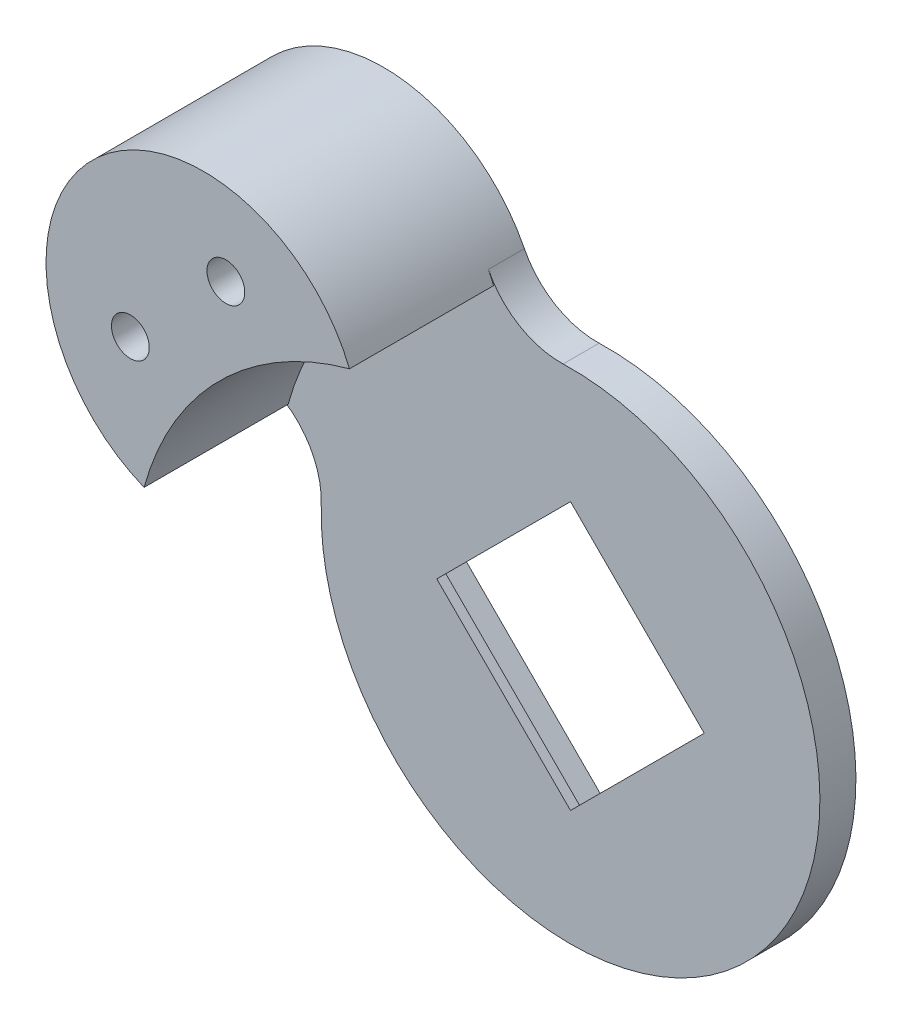
ISO-10303-21;
HEADER;
FILE_DESCRIPTION(('STEP AP214'),'2;1');
FILE_NAME('part.step','',(''),(''),'','','');
FILE_SCHEMA(('AUTOMOTIVE_DESIGN { 1 0 10303 214 1 1 1 1 }'));
ENDSEC;
DATA;
#1=APPLICATION_CONTEXT('core data for automotive mechanical design processes');
#2=APPLICATION_PROTOCOL_DEFINITION('international standard','automotive_design',2000,#1);
#3=PRODUCT_CONTEXT('',#1,'mechanical');
#4=PRODUCT('Part','Part','',(#3));
#5=PRODUCT_RELATED_PRODUCT_CATEGORY('part','',(#4));
#6=PRODUCT_DEFINITION_FORMATION('','',#4);
#7=PRODUCT_DEFINITION_CONTEXT('part definition',#1,'design');
#8=PRODUCT_DEFINITION('design','',#6,#7);
#9=PRODUCT_DEFINITION_SHAPE('','',#8);
#10=(LENGTH_UNIT() NAMED_UNIT(*) SI_UNIT(.MILLI.,.METRE.));
#11=(NAMED_UNIT(*) PLANE_ANGLE_UNIT() SI_UNIT($,.RADIAN.));
#12=(NAMED_UNIT(*) SI_UNIT($,.STERADIAN.) SOLID_ANGLE_UNIT());
#13=UNCERTAINTY_MEASURE_WITH_UNIT(LENGTH_MEASURE(1.E-05),#10,'distance_accuracy_value','');
#14=(GEOMETRIC_REPRESENTATION_CONTEXT(3) GLOBAL_UNCERTAINTY_ASSIGNED_CONTEXT((#13)) GLOBAL_UNIT_ASSIGNED_CONTEXT((#10,
#11,#12)) REPRESENTATION_CONTEXT('',''));
#15=CARTESIAN_POINT('',(0.,0.,0.));
#16=DIRECTION('',(0.,0.,1.));
#17=DIRECTION('',(1.,0.,0.));
#18=AXIS2_PLACEMENT_3D('',#15,#16,#17);
#19=CARTESIAN_POINT('',(-38.0544919220306,-11.2881540550876,-1.));
#20=DIRECTION('',(0.,0.,1.));
#21=DIRECTION('',(1.,0.,0.));
#22=AXIS2_PLACEMENT_3D('',#19,#20,#21);
#23=PLANE('',#22);
#24=DIRECTION('',(-0.707106781186551,0.707106781186545,0.));
#25=VECTOR('',#24,1.);
#26=CARTESIAN_POINT('',(-23.6035495252337,-24.2058564222823,-1.));
#27=LINE('',#26,#25);
#28=CARTESIAN_POINT('',(-7.340093557943,-40.4693123895728,-1.));
#29=VERTEX_POINT('',#28);
#30=CARTESIAN_POINT('',(-23.6035495252337,-24.2058564222823,-1.));
#31=VERTEX_POINT('',#30);
#32=EDGE_CURVE('E183',#29,#31,#27,.T.);
#33=ORIENTED_EDGE('',*,*,#32,.T.);
#34=DIRECTION('',(0.707106781186544,0.707106781186551,0.));
#35=VECTOR('',#34,1.);
#36=CARTESIAN_POINT('',(-23.6035495252337,-24.2058564222823,-1.));
#37=LINE('',#36,#35);
#38=CARTESIAN_POINT('',(-7.34009355794314,-7.94240045499165,-1.));
#39=VERTEX_POINT('',#38);
#40=EDGE_CURVE('E171',#31,#39,#37,.T.);
#41=ORIENTED_EDGE('',*,*,#40,.T.);
#42=DIRECTION('',(0.707106781186551,-0.707106781186545,0.));
#43=VECTOR('',#42,1.);
#44=CARTESIAN_POINT('',(-7.34009355794314,-7.94240045499165,-1.));
#45=LINE('',#44,#43);
#46=CARTESIAN_POINT('',(8.92336240934752,-24.2058564222822,-1.));
#47=VERTEX_POINT('',#46);
#48=EDGE_CURVE('E192',#39,#47,#45,.T.);
#49=ORIENTED_EDGE('',*,*,#48,.T.);
#50=DIRECTION('',(-0.707106781186544,-0.707106781186551,0.));
#51=VECTOR('',#50,1.);
#52=CARTESIAN_POINT('',(-7.340093557943,-40.4693123895728,-1.));
#53=LINE('',#52,#51);
#54=EDGE_CURVE('E188',#47,#29,#53,.T.);
#55=ORIENTED_EDGE('',*,*,#54,.T.);
#56=EDGE_LOOP('',(#33,#41,#49,#55));
#57=FACE_BOUND('',#56,.T.);
#58=DIRECTION('',(-0.707106781186544,-0.707106781186551,0.));
#59=VECTOR('',#58,1.);
#60=CARTESIAN_POINT('',(7.50914884697442,-24.2058564222822,-1.));
#61=LINE('',#60,#59);
#62=CARTESIAN_POINT('',(7.50914884697442,-24.2058564222822,-1.));
#63=VERTEX_POINT('',#62);
#64=CARTESIAN_POINT('',(-7.340093557943,-39.0550988271997,-1.));
#65=VERTEX_POINT('',#64);
#66=EDGE_CURVE('E152',#63,#65,#61,.T.);
#67=ORIENTED_EDGE('',*,*,#66,.F.);
#68=DIRECTION('',(0.707106781186551,-0.707106781186545,0.));
#69=VECTOR('',#68,1.);
#70=CARTESIAN_POINT('',(-7.34009355794314,-9.35661401736475,-1.));
#71=LINE('',#70,#69);
#72=CARTESIAN_POINT('',(-7.34009355794314,-9.35661401736475,-1.));
#73=VERTEX_POINT('',#72);
#74=EDGE_CURVE('E149',#73,#63,#71,.T.);
#75=ORIENTED_EDGE('',*,*,#74,.F.);
#76=DIRECTION('',(0.707106781186544,0.707106781186551,0.));
#77=VECTOR('',#76,1.);
#78=CARTESIAN_POINT('',(-22.1893359628606,-24.2058564222823,-1.));
#79=LINE('',#78,#77);
#80=CARTESIAN_POINT('',(-22.1893359628606,-24.2058564222823,-1.));
#81=VERTEX_POINT('',#80);
#82=EDGE_CURVE('E56',#81,#73,#79,.T.);
#83=ORIENTED_EDGE('',*,*,#82,.F.);
#84=DIRECTION('',(-0.707106781186551,0.707106781186545,0.));
#85=VECTOR('',#84,1.);
#86=CARTESIAN_POINT('',(-7.340093557943,-39.0550988271997,-1.));
#87=LINE('',#86,#85);
#88=EDGE_CURVE('E144',#65,#81,#87,.T.);
#89=ORIENTED_EDGE('',*,*,#88,.F.);
#90=EDGE_LOOP('',(#67,#75,#83,#89));
#91=FACE_BOUND('',#90,.T.);
#92=ADVANCED_FACE('F41',(#57,#91),#23,.F.);
#93=CARTESIAN_POINT('',(-7.34009355794329,-24.2058564222818,16.));
#94=DIRECTION('',(0.,0.,-1.));
#95=DIRECTION('',(-1.,0.,0.));
#96=AXIS2_PLACEMENT_3D('',#93,#94,#95);
#97=CYLINDRICAL_SURFACE('',#96,32.5);
#98=CARTESIAN_POINT('',(-7.34009355794329,-24.2058564222818,0.));
#99=DIRECTION('',(0.,0.,-1.));
#100=DIRECTION('',(1.,0.,0.));
#101=AXIS2_PLACEMENT_3D('',#98,#99,#100);
#102=CIRCLE('',#101,32.5);
#103=CARTESIAN_POINT('',(-38.6968344719005,-15.6615718264268,0.));
#104=VERTEX_POINT('',#103);
#105=CARTESIAN_POINT('',(-15.8843781537988,7.15088449167523,0.));
#106=VERTEX_POINT('',#105);
#107=EDGE_CURVE('E247',#104,#106,#102,.T.);
#108=ORIENTED_EDGE('',*,*,#107,.T.);
#109=DIRECTION('',(0.,0.,-1.));
#110=VECTOR('',#109,1.);
#111=CARTESIAN_POINT('',(-15.8843781537988,7.15088449167523,16.));
#112=LINE('',#111,#110);
#113=CARTESIAN_POINT('',(-15.8843781537988,7.15088449167523,16.));
#114=VERTEX_POINT('',#113);
#115=EDGE_CURVE('E262',#114,#106,#112,.T.);
#116=ORIENTED_EDGE('',*,*,#115,.F.);
#117=CARTESIAN_POINT('',(-7.34009355794329,-24.2058564222818,16.));
#118=DIRECTION('',(0.,0.,-1.));
#119=DIRECTION('',(1.,0.,0.));
#120=AXIS2_PLACEMENT_3D('',#117,#118,#119);
#121=CIRCLE('',#120,32.5);
#122=CARTESIAN_POINT('',(-38.6968344719005,-15.6615718264268,16.));
#123=VERTEX_POINT('',#122);
#124=EDGE_CURVE('E248',#123,#114,#121,.T.);
#125=ORIENTED_EDGE('',*,*,#124,.F.);
#126=DIRECTION('',(0.,0.,-1.));
#127=VECTOR('',#126,1.);
#128=CARTESIAN_POINT('',(-38.6968344719005,-15.6615718264268,16.));
#129=LINE('',#128,#127);
#130=EDGE_CURVE('E254',#123,#104,#129,.T.);
#131=ORIENTED_EDGE('',*,*,#130,.T.);
#132=EDGE_LOOP('',(#108,#116,#125,#131));
#133=FACE_BOUND('',#132,.T.);
#134=ADVANCED_FACE('F43',(#133),#97,.F.);
#135=CARTESIAN_POINT('',(-32.0888308994729,0.542880919247368,16.));
#136=DIRECTION('',(0.,0.,-1.));
#137=DIRECTION('',(-1.,0.,0.));
#138=AXIS2_PLACEMENT_3D('',#135,#136,#137);
#139=CYLINDRICAL_SURFACE('',#138,17.5000000000001);
#140=CARTESIAN_POINT('',(-32.0888308994729,0.542880919247368,0.));
#141=DIRECTION('',(0.,0.,1.));
#142=DIRECTION('',(1.,0.,0.));
#143=AXIS2_PLACEMENT_3D('',#140,#141,#142);
#144=CIRCLE('',#143,17.5000000000001);
#145=CARTESIAN_POINT('',(-16.4629356503513,8.42205585470107,0.));
#146=VERTEX_POINT('',#145);
#147=EDGE_CURVE('E252',#106,#146,#144,.T.);
#148=ORIENTED_EDGE('',*,*,#147,.T.);
#149=DIRECTION('',(0.,0.,1.));
#150=VECTOR('',#149,1.);
#151=CARTESIAN_POINT('',(-16.4629356503513,8.42205585470107,-4.));
#152=LINE('',#151,#150);
#153=CARTESIAN_POINT('',(-16.4629356503513,8.42205585470107,-4.));
#154=VERTEX_POINT('',#153);
#155=EDGE_CURVE('E242',#154,#146,#152,.T.);
#156=ORIENTED_EDGE('',*,*,#155,.F.);
#157=CARTESIAN_POINT('',(-32.0888308994729,0.542880919247368,-4.));
#158=DIRECTION('',(0.,0.,-1.));
#159=DIRECTION('',(-1.,0.,0.));
#160=AXIS2_PLACEMENT_3D('',#157,#158,#159);
#161=CIRCLE('',#160,17.5000000000001);
#162=CARTESIAN_POINT('',(-39.9680058349265,-15.0830143298743,-4.));
#163=VERTEX_POINT('',#162);
#164=EDGE_CURVE('E224',#163,#154,#161,.T.);
#165=ORIENTED_EDGE('',*,*,#164,.F.);
#166=DIRECTION('',(0.,0.,1.));
#167=VECTOR('',#166,1.);
#168=CARTESIAN_POINT('',(-39.9680058349265,-15.0830143298743,-4.));
#169=LINE('',#168,#167);
#170=CARTESIAN_POINT('',(-39.9680058349265,-15.0830143298743,0.));
#171=VERTEX_POINT('',#170);
#172=EDGE_CURVE('E244',#163,#171,#169,.T.);
#173=ORIENTED_EDGE('',*,*,#172,.T.);
#174=EDGE_CURVE('E257',#171,#104,#144,.T.);
#175=ORIENTED_EDGE('',*,*,#174,.T.);
#176=ORIENTED_EDGE('',*,*,#130,.F.);
#177=CARTESIAN_POINT('',(-32.0888308994729,0.542880919247368,16.));
#178=DIRECTION('',(0.,0.,1.));
#179=DIRECTION('',(1.,0.,0.));
#180=AXIS2_PLACEMENT_3D('',#177,#178,#179);
#181=CIRCLE('',#180,17.5000000000001);
#182=EDGE_CURVE('E251',#114,#123,#181,.T.);
#183=ORIENTED_EDGE('',*,*,#182,.F.);
#184=ORIENTED_EDGE('',*,*,#115,.T.);
#185=EDGE_LOOP('',(#148,#156,#165,#173,#175,#176,#183,#184));
#186=FACE_BOUND('',#185,.T.);
#187=ADVANCED_FACE('F289',(#186),#139,.T.);
#188=CARTESIAN_POINT('',(-19.7144622287081,-11.8314877515172,16.));
#189=DIRECTION('',(0.,0.,1.));
#190=DIRECTION('',(1.,0.,0.));
#191=AXIS2_PLACEMENT_3D('',#188,#189,#190);
#192=PLANE('',#191);
#193=CARTESIAN_POINT('',(-40.2205588831182,-1.93199281490557,16.));
#194=DIRECTION('',(0.,0.,-1.));
#195=DIRECTION('',(-1.,0.,0.));
#196=AXIS2_PLACEMENT_3D('',#193,#194,#195);
#197=CIRCLE('',#196,2.1);
#198=CARTESIAN_POINT('',(-42.3205588831182,-1.93199281490557,16.));
#199=VERTEX_POINT('',#198);
#200=EDGE_CURVE('E213',#199,#199,#197,.T.);
#201=ORIENTED_EDGE('',*,*,#200,.T.);
#202=EDGE_LOOP('',(#201));
#203=FACE_BOUND('',#202,.T.);
#204=CARTESIAN_POINT('',(-29.61395716532,8.67460890289268,16.));
#205=DIRECTION('',(0.,0.,-1.));
#206=DIRECTION('',(-1.,0.,0.));
#207=AXIS2_PLACEMENT_3D('',#204,#205,#206);
#208=CIRCLE('',#207,2.1);
#209=CARTESIAN_POINT('',(-31.71395716532,8.67460890289268,16.));
#210=VERTEX_POINT('',#209);
#211=EDGE_CURVE('E217',#210,#210,#208,.T.);
#212=ORIENTED_EDGE('',*,*,#211,.T.);
#213=EDGE_LOOP('',(#212));
#214=FACE_BOUND('',#213,.T.);
#215=ORIENTED_EDGE('',*,*,#124,.T.);
#216=ORIENTED_EDGE('',*,*,#182,.T.);
#217=EDGE_LOOP('',(#215,#216));
#218=FACE_BOUND('',#217,.T.);
#219=ADVANCED_FACE('F357',(#203,#214,#218),#192,.T.);
#220=CARTESIAN_POINT('',(-44.0201529445883,-23.1191890294226,-4.));
#221=DIRECTION('',(0.,0.,1.));
#222=DIRECTION('',(1.,0.,0.));
#223=AXIS2_PLACEMENT_3D('',#220,#221,#222);
#224=CYLINDRICAL_SURFACE('',#223,9.);
#225=CARTESIAN_POINT('',(-44.0201529445883,-23.1191890294226,0.));
#226=DIRECTION('',(0.,0.,1.));
#227=DIRECTION('',(1.,0.,0.));
#228=AXIS2_PLACEMENT_3D('',#225,#226,#227);
#229=CIRCLE('',#228,9.);
#230=CARTESIAN_POINT('',(-35.0240998794845,-23.3857021620006,0.));
#231=VERTEX_POINT('',#230);
#232=EDGE_CURVE('E216',#231,#171,#229,.T.);
#233=ORIENTED_EDGE('',*,*,#232,.T.);
#234=ORIENTED_EDGE('',*,*,#172,.F.);
#235=CARTESIAN_POINT('',(-44.0201529445883,-23.1191890294226,-4.));
#236=DIRECTION('',(0.,0.,1.));
#237=DIRECTION('',(1.,0.,0.));
#238=AXIS2_PLACEMENT_3D('',#235,#236,#237);
#239=CIRCLE('',#238,9.);
#240=CARTESIAN_POINT('',(-35.0240998794845,-23.3857021620006,-4.));
#241=VERTEX_POINT('',#240);
#242=EDGE_CURVE('E221',#241,#163,#239,.T.);
#243=ORIENTED_EDGE('',*,*,#242,.F.);
#244=DIRECTION('',(0.,0.,1.));
#245=VECTOR('',#244,1.);
#246=CARTESIAN_POINT('',(-35.0240998794845,-23.3857021620006,-4.));
#247=LINE('',#246,#245);
#248=EDGE_CURVE('E231',#241,#231,#247,.T.);
#249=ORIENTED_EDGE('',*,*,#248,.T.);
#250=EDGE_LOOP('',(#233,#234,#243,#249));
#251=FACE_BOUND('',#250,.T.);
#252=ADVANCED_FACE('F296',(#251),#224,.F.);
#253=CARTESIAN_POINT('',(-8.42676095080308,12.474202964363,-4.));
#254=DIRECTION('',(0.,0.,1.));
#255=DIRECTION('',(1.,0.,0.));
#256=AXIS2_PLACEMENT_3D('',#253,#254,#255);
#257=CYLINDRICAL_SURFACE('',#256,9.);
#258=CARTESIAN_POINT('',(-8.42676095080308,12.474202964363,0.));
#259=DIRECTION('',(0.,0.,1.));
#260=DIRECTION('',(-1.,0.,0.));
#261=AXIS2_PLACEMENT_3D('',#258,#259,#260);
#262=CIRCLE('',#261,9.);
#263=CARTESIAN_POINT('',(-8.16024781822495,3.47814989925916,0.));
#264=VERTEX_POINT('',#263);
#265=EDGE_CURVE('E234',#146,#264,#262,.T.);
#266=ORIENTED_EDGE('',*,*,#265,.T.);
#267=DIRECTION('',(0.,0.,1.));
#268=VECTOR('',#267,1.);
#269=CARTESIAN_POINT('',(-8.16024781822495,3.47814989925916,-4.));
#270=LINE('',#269,#268);
#271=CARTESIAN_POINT('',(-8.16024781822495,3.47814989925916,-4.));
#272=VERTEX_POINT('',#271);
#273=EDGE_CURVE('E239',#272,#264,#270,.T.);
#274=ORIENTED_EDGE('',*,*,#273,.F.);
#275=CARTESIAN_POINT('',(-8.42676095080308,12.474202964363,-4.));
#276=DIRECTION('',(0.,0.,1.));
#277=DIRECTION('',(-1.,0.,0.));
#278=AXIS2_PLACEMENT_3D('',#275,#276,#277);
#279=CIRCLE('',#278,9.);
#280=EDGE_CURVE('E227',#154,#272,#279,.T.);
#281=ORIENTED_EDGE('',*,*,#280,.F.);
#282=ORIENTED_EDGE('',*,*,#155,.T.);
#283=EDGE_LOOP('',(#266,#274,#281,#282));
#284=FACE_BOUND('',#283,.T.);
#285=ADVANCED_FACE('F305',(#284),#257,.F.);
#286=CARTESIAN_POINT('',(-7.34009355794307,-24.2058564222822,-4.));
#287=DIRECTION('',(0.,0.,1.));
#288=DIRECTION('',(1.,0.,0.));
#289=AXIS2_PLACEMENT_3D('',#286,#287,#288);
#290=CYLINDRICAL_SURFACE('',#289,27.6961524227067);
#291=CARTESIAN_POINT('',(-7.34009355794307,-24.2058564222822,0.));
#292=DIRECTION('',(0.,0.,-1.));
#293=DIRECTION('',(-1.,0.,0.));
#294=AXIS2_PLACEMENT_3D('',#291,#292,#293);
#295=CIRCLE('',#294,27.6961524227067);
#296=EDGE_CURVE('E225',#264,#231,#295,.T.);
#297=ORIENTED_EDGE('',*,*,#296,.T.);
#298=ORIENTED_EDGE('',*,*,#248,.F.);
#299=CARTESIAN_POINT('',(-7.34009355794307,-24.2058564222822,-4.));
#300=DIRECTION('',(0.,0.,-1.));
#301=DIRECTION('',(-1.,0.,0.));
#302=AXIS2_PLACEMENT_3D('',#299,#300,#301);
#303=CIRCLE('',#302,27.6961524227067);
#304=EDGE_CURVE('E229',#272,#241,#303,.T.);
#305=ORIENTED_EDGE('',*,*,#304,.F.);
#306=ORIENTED_EDGE('',*,*,#273,.T.);
#307=EDGE_LOOP('',(#297,#298,#305,#306));
#308=FACE_BOUND('',#307,.T.);
#309=ADVANCED_FACE('F301',(#308),#290,.T.);
#310=CARTESIAN_POINT('',(-38.0544919220306,-11.2881540550876,-4.));
#311=DIRECTION('',(0.,0.,1.));
#312=DIRECTION('',(1.,0.,0.));
#313=AXIS2_PLACEMENT_3D('',#310,#311,#312);
#314=PLANE('',#313);
#315=DIRECTION('',(0.70710678118655,-0.707106781186544,0.));
#316=VECTOR('',#315,1.);
#317=CARTESIAN_POINT('',(-7.34009355794314,-7.94240045499165,-4.));
#318=LINE('',#317,#316);
#319=CARTESIAN_POINT('',(-7.34009355794314,-7.94240045499165,-4.));
#320=VERTEX_POINT('',#319);
#321=CARTESIAN_POINT('',(8.92336240934752,-24.2058564222822,-4.));
#322=VERTEX_POINT('',#321);
#323=EDGE_CURVE('E172',#320,#322,#318,.T.);
#324=ORIENTED_EDGE('',*,*,#323,.F.);
#325=DIRECTION('',(0.707106781186544,0.707106781186551,0.));
#326=VECTOR('',#325,1.);
#327=CARTESIAN_POINT('',(-23.6035495252337,-24.2058564222823,-4.));
#328=LINE('',#327,#326);
#329=CARTESIAN_POINT('',(-23.6035495252337,-24.2058564222823,-4.));
#330=VERTEX_POINT('',#329);
#331=EDGE_CURVE('E175',#330,#320,#328,.T.);
#332=ORIENTED_EDGE('',*,*,#331,.F.);
#333=DIRECTION('',(-0.70710678118655,0.707106781186544,0.));
#334=VECTOR('',#333,1.);
#335=CARTESIAN_POINT('',(-23.6035495252337,-24.2058564222823,-4.));
#336=LINE('',#335,#334);
#337=CARTESIAN_POINT('',(-7.340093557943,-40.4693123895728,-4.));
#338=VERTEX_POINT('',#337);
#339=EDGE_CURVE('E165',#338,#330,#336,.T.);
#340=ORIENTED_EDGE('',*,*,#339,.F.);
#341=DIRECTION('',(-0.707106781186544,-0.707106781186551,0.));
#342=VECTOR('',#341,1.);
#343=CARTESIAN_POINT('',(-7.340093557943,-40.4693123895728,-4.));
#344=LINE('',#343,#342);
#345=EDGE_CURVE('E169',#322,#338,#344,.T.);
#346=ORIENTED_EDGE('',*,*,#345,.F.);
#347=EDGE_LOOP('',(#324,#332,#340,#346));
#348=FACE_BOUND('',#347,.T.);
#349=CARTESIAN_POINT('',(-40.2205588831182,-1.93199281490557,-4.));
#350=DIRECTION('',(0.,0.,-1.));
#351=DIRECTION('',(-1.,0.,0.));
#352=AXIS2_PLACEMENT_3D('',#349,#350,#351);
#353=CIRCLE('',#352,4.00000000000001);
#354=CARTESIAN_POINT('',(-44.2205588831182,-1.93199281490557,-4.));
#355=VERTEX_POINT('',#354);
#356=EDGE_CURVE('E201',#355,#355,#353,.T.);
#357=ORIENTED_EDGE('',*,*,#356,.F.);
#358=EDGE_LOOP('',(#357));
#359=FACE_BOUND('',#358,.T.);
#360=CARTESIAN_POINT('',(-29.61395716532,8.67460890289268,-4.));
#361=DIRECTION('',(0.,0.,-1.));
#362=DIRECTION('',(-1.,0.,0.));
#363=AXIS2_PLACEMENT_3D('',#360,#361,#362);
#364=CIRCLE('',#363,4.00000000000001);
#365=CARTESIAN_POINT('',(-33.61395716532,8.67460890289268,-4.));
#366=VERTEX_POINT('',#365);
#367=EDGE_CURVE('E205',#366,#366,#364,.T.);
#368=ORIENTED_EDGE('',*,*,#367,.F.);
#369=EDGE_LOOP('',(#368));
#370=FACE_BOUND('',#369,.T.);
#371=ORIENTED_EDGE('',*,*,#242,.T.);
#372=ORIENTED_EDGE('',*,*,#164,.T.);
#373=ORIENTED_EDGE('',*,*,#280,.T.);
#374=ORIENTED_EDGE('',*,*,#304,.T.);
#375=EDGE_LOOP('',(#371,#372,#373,#374));
#376=FACE_BOUND('',#375,.T.);
#377=ADVANCED_FACE('F281',(#348,#359,#370,#376),#314,.F.);
#378=CARTESIAN_POINT('',(-38.0544919220306,-11.2881540550876,0.));
#379=DIRECTION('',(0.,0.,1.));
#380=DIRECTION('',(1.,0.,0.));
#381=AXIS2_PLACEMENT_3D('',#378,#379,#380);
#382=PLANE('',#381);
#383=DIRECTION('',(0.707106781186544,0.707106781186551,0.));
#384=VECTOR('',#383,1.);
#385=CARTESIAN_POINT('',(-8.81382035393059,-40.5288256231873,0.));
#386=LINE('',#385,#384);
#387=CARTESIAN_POINT('',(-7.340093557943,-39.0550988271997,0.));
#388=VERTEX_POINT('',#387);
#389=CARTESIAN_POINT('',(7.50914884697442,-24.2058564222822,0.));
#390=VERTEX_POINT('',#389);
#391=EDGE_CURVE('E12',#388,#390,#386,.T.);
#392=ORIENTED_EDGE('',*,*,#391,.F.);
#393=DIRECTION('',(0.707106781186551,-0.707106781186545,0.));
#394=VECTOR('',#393,1.);
#395=CARTESIAN_POINT('',(-36.580765126043,-9.81442725909999,0.));
#396=LINE('',#395,#394);
#397=CARTESIAN_POINT('',(-22.1893359628606,-24.2058564222823,0.));
#398=VERTEX_POINT('',#397);
#399=EDGE_CURVE('E146',#398,#388,#396,.T.);
#400=ORIENTED_EDGE('',*,*,#399,.F.);
#401=DIRECTION('',(-0.707106781186544,-0.707106781186551,0.));
#402=VECTOR('',#401,1.);
#403=CARTESIAN_POINT('',(-23.6630627588481,-25.6795832182699,0.));
#404=LINE('',#403,#402);
#405=CARTESIAN_POINT('',(-7.34009355794314,-9.35661401736475,0.));
#406=VERTEX_POINT('',#405);
#407=EDGE_CURVE('E270',#406,#398,#404,.T.);
#408=ORIENTED_EDGE('',*,*,#407,.F.);
#409=DIRECTION('',(-0.70710678118655,0.707106781186545,0.));
#410=VECTOR('',#409,1.);
#411=CARTESIAN_POINT('',(-21.7315227211256,5.03481514581756,0.));
#412=LINE('',#411,#410);
#413=EDGE_CURVE('E49',#390,#406,#412,.T.);
#414=ORIENTED_EDGE('',*,*,#413,.F.);
#415=EDGE_LOOP('',(#392,#400,#408,#414));
#416=FACE_BOUND('',#415,.T.);
#417=ORIENTED_EDGE('',*,*,#147,.F.);
#418=ORIENTED_EDGE('',*,*,#107,.F.);
#419=ORIENTED_EDGE('',*,*,#174,.F.);
#420=ORIENTED_EDGE('',*,*,#232,.F.);
#421=ORIENTED_EDGE('',*,*,#296,.F.);
#422=ORIENTED_EDGE('',*,*,#265,.F.);
#423=EDGE_LOOP('',(#417,#418,#419,#420,#421,#422));
#424=FACE_BOUND('',#423,.T.);
#425=ADVANCED_FACE('F277',(#416,#424),#382,.T.);
#426=CARTESIAN_POINT('',(-29.61395716532,8.67460890289268,16.));
#427=DIRECTION('',(0.,0.,-1.));
#428=DIRECTION('',(-1.,0.,0.));
#429=AXIS2_PLACEMENT_3D('',#426,#427,#428);
#430=CYLINDRICAL_SURFACE('',#429,2.1);
#431=CARTESIAN_POINT('',(-29.61395716532,8.67460890289268,10.));
#432=DIRECTION('',(0.,0.,1.));
#433=DIRECTION('',(1.,0.,0.));
#434=AXIS2_PLACEMENT_3D('',#431,#432,#433);
#435=CIRCLE('',#434,2.1);
#436=CARTESIAN_POINT('',(-27.51395716532,8.67460890289268,10.));
#437=VERTEX_POINT('',#436);
#438=EDGE_CURVE('E220',#437,#437,#435,.F.);
#439=ORIENTED_EDGE('',*,*,#438,.T.);
#440=EDGE_LOOP('',(#439));
#441=FACE_BOUND('',#440,.T.);
#442=ORIENTED_EDGE('',*,*,#211,.F.);
#443=EDGE_LOOP('',(#442));
#444=FACE_BOUND('',#443,.T.);
#445=ADVANCED_FACE('F280',(#441,#444),#430,.F.);
#446=CARTESIAN_POINT('',(-40.2205588831182,-1.93199281490557,16.));
#447=DIRECTION('',(0.,0.,-1.));
#448=DIRECTION('',(-1.,0.,0.));
#449=AXIS2_PLACEMENT_3D('',#446,#447,#448);
#450=CYLINDRICAL_SURFACE('',#449,2.1);
#451=CARTESIAN_POINT('',(-40.2205588831182,-1.93199281490557,10.));
#452=DIRECTION('',(0.,0.,1.));
#453=DIRECTION('',(1.,0.,0.));
#454=AXIS2_PLACEMENT_3D('',#451,#452,#453);
#455=CIRCLE('',#454,2.1);
#456=CARTESIAN_POINT('',(-38.1205588831182,-1.93199281490557,10.));
#457=VERTEX_POINT('',#456);
#458=EDGE_CURVE('E208',#457,#457,#455,.F.);
#459=ORIENTED_EDGE('',*,*,#458,.T.);
#460=EDGE_LOOP('',(#459));
#461=FACE_BOUND('',#460,.T.);
#462=ORIENTED_EDGE('',*,*,#200,.F.);
#463=EDGE_LOOP('',(#462));
#464=FACE_BOUND('',#463,.T.);
#465=ADVANCED_FACE('F338',(#461,#464),#450,.F.);
#466=CARTESIAN_POINT('',(-19.7144622287081,-11.8314877515172,10.));
#467=DIRECTION('',(0.,0.,1.));
#468=DIRECTION('',(1.,0.,0.));
#469=AXIS2_PLACEMENT_3D('',#466,#467,#468);
#470=PLANE('',#469);
#471=CARTESIAN_POINT('',(-40.2205588831182,-1.93199281490557,10.));
#472=DIRECTION('',(0.,0.,1.));
#473=DIRECTION('',(1.,0.,0.));
#474=AXIS2_PLACEMENT_3D('',#471,#472,#473);
#475=CIRCLE('',#474,4.00000000000001);
#476=CARTESIAN_POINT('',(-36.2205588831182,-1.93199281490557,10.));
#477=VERTEX_POINT('',#476);
#478=EDGE_CURVE('E204',#477,#477,#475,.F.);
#479=ORIENTED_EDGE('',*,*,#478,.T.);
#480=EDGE_LOOP('',(#479));
#481=FACE_BOUND('',#480,.T.);
#482=ORIENTED_EDGE('',*,*,#458,.F.);
#483=EDGE_LOOP('',(#482));
#484=FACE_BOUND('',#483,.T.);
#485=ADVANCED_FACE('F334',(#481,#484),#470,.F.);
#486=CARTESIAN_POINT('',(-40.2205588831182,-1.93199281490557,27.3137084989848));
#487=DIRECTION('',(0.,0.,-1.));
#488=DIRECTION('',(-1.,0.,0.));
#489=AXIS2_PLACEMENT_3D('',#486,#487,#488);
#490=CYLINDRICAL_SURFACE('',#489,4.00000000000001);
#491=ORIENTED_EDGE('',*,*,#356,.T.);
#492=EDGE_LOOP('',(#491));
#493=FACE_BOUND('',#492,.T.);
#494=ORIENTED_EDGE('',*,*,#478,.F.);
#495=EDGE_LOOP('',(#494));
#496=FACE_BOUND('',#495,.T.);
#497=ADVANCED_FACE('F330',(#493,#496),#490,.F.);
#498=CARTESIAN_POINT('',(-19.7144622287081,-11.8314877515172,10.));
#499=DIRECTION('',(0.,0.,1.));
#500=DIRECTION('',(1.,0.,0.));
#501=AXIS2_PLACEMENT_3D('',#498,#499,#500);
#502=PLANE('',#501);
#503=CARTESIAN_POINT('',(-29.61395716532,8.67460890289268,10.));
#504=DIRECTION('',(0.,0.,1.));
#505=DIRECTION('',(1.,0.,0.));
#506=AXIS2_PLACEMENT_3D('',#503,#504,#505);
#507=CIRCLE('',#506,4.00000000000001);
#508=CARTESIAN_POINT('',(-25.61395716532,8.67460890289268,10.));
#509=VERTEX_POINT('',#508);
#510=EDGE_CURVE('E200',#509,#509,#507,.F.);
#511=ORIENTED_EDGE('',*,*,#510,.T.);
#512=EDGE_LOOP('',(#511));
#513=FACE_BOUND('',#512,.T.);
#514=ORIENTED_EDGE('',*,*,#438,.F.);
#515=EDGE_LOOP('',(#514));
#516=FACE_BOUND('',#515,.T.);
#517=ADVANCED_FACE('F333',(#513,#516),#502,.F.);
#518=CARTESIAN_POINT('',(-29.61395716532,8.67460890289268,27.3137084989848));
#519=DIRECTION('',(0.,0.,-1.));
#520=DIRECTION('',(-1.,0.,0.));
#521=AXIS2_PLACEMENT_3D('',#518,#519,#520);
#522=CYLINDRICAL_SURFACE('',#521,4.00000000000001);
#523=ORIENTED_EDGE('',*,*,#367,.T.);
#524=EDGE_LOOP('',(#523));
#525=FACE_BOUND('',#524,.T.);
#526=ORIENTED_EDGE('',*,*,#510,.F.);
#527=EDGE_LOOP('',(#526));
#528=FACE_BOUND('',#527,.T.);
#529=ADVANCED_FACE('F342',(#525,#528),#522,.F.);
#530=CARTESIAN_POINT('',(-23.6035495252337,-24.2058564222823,46.));
#531=DIRECTION('',(-0.707106781186551,0.707106781186544,0.));
#532=DIRECTION('',(-0.707106781186544,-0.707106781186551,0.));
#533=AXIS2_PLACEMENT_3D('',#530,#531,#532);
#534=PLANE('',#533);
#535=DIRECTION('',(0.,0.,-1.));
#536=VECTOR('',#535,1.);
#537=CARTESIAN_POINT('',(-23.6035495252337,-24.2058564222823,46.));
#538=LINE('',#537,#536);
#539=EDGE_CURVE('E186',#31,#330,#538,.T.);
#540=ORIENTED_EDGE('',*,*,#539,.T.);
#541=ORIENTED_EDGE('',*,*,#331,.T.);
#542=DIRECTION('',(0.,0.,-1.));
#543=VECTOR('',#542,1.);
#544=CARTESIAN_POINT('',(-7.34009355794314,-7.94240045499165,46.));
#545=LINE('',#544,#543);
#546=EDGE_CURVE('E182',#39,#320,#545,.T.);
#547=ORIENTED_EDGE('',*,*,#546,.F.);
#548=ORIENTED_EDGE('',*,*,#40,.F.);
#549=EDGE_LOOP('',(#540,#541,#547,#548));
#550=FACE_BOUND('',#549,.T.);
#551=ADVANCED_FACE('F328',(#550),#534,.F.);
#552=CARTESIAN_POINT('',(-7.34009355794314,-7.94240045499165,46.));
#553=DIRECTION('',(0.707106781186544,0.70710678118655,0.));
#554=DIRECTION('',(-0.707106781186551,0.707106781186545,0.));
#555=AXIS2_PLACEMENT_3D('',#552,#553,#554);
#556=PLANE('',#555);
#557=ORIENTED_EDGE('',*,*,#546,.T.);
#558=ORIENTED_EDGE('',*,*,#323,.T.);
#559=DIRECTION('',(0.,0.,-1.));
#560=VECTOR('',#559,1.);
#561=CARTESIAN_POINT('',(8.92336240934752,-24.2058564222822,46.));
#562=LINE('',#561,#560);
#563=EDGE_CURVE('E191',#47,#322,#562,.T.);
#564=ORIENTED_EDGE('',*,*,#563,.F.);
#565=ORIENTED_EDGE('',*,*,#48,.F.);
#566=EDGE_LOOP('',(#557,#558,#564,#565));
#567=FACE_BOUND('',#566,.T.);
#568=ADVANCED_FACE('F431',(#567),#556,.F.);
#569=CARTESIAN_POINT('',(-7.340093557943,-40.4693123895728,46.));
#570=DIRECTION('',(0.707106781186551,-0.707106781186544,0.));
#571=DIRECTION('',(0.707106781186544,0.707106781186551,0.));
#572=AXIS2_PLACEMENT_3D('',#569,#570,#571);
#573=PLANE('',#572);
#574=ORIENTED_EDGE('',*,*,#563,.T.);
#575=ORIENTED_EDGE('',*,*,#345,.T.);
#576=DIRECTION('',(0.,0.,-1.));
#577=VECTOR('',#576,1.);
#578=CARTESIAN_POINT('',(-7.340093557943,-40.4693123895728,46.));
#579=LINE('',#578,#577);
#580=EDGE_CURVE('E187',#29,#338,#579,.T.);
#581=ORIENTED_EDGE('',*,*,#580,.F.);
#582=ORIENTED_EDGE('',*,*,#54,.F.);
#583=EDGE_LOOP('',(#574,#575,#581,#582));
#584=FACE_BOUND('',#583,.T.);
#585=ADVANCED_FACE('F440',(#584),#573,.F.);
#586=CARTESIAN_POINT('',(-23.6035495252337,-24.2058564222823,46.));
#587=DIRECTION('',(-0.707106781186544,-0.70710678118655,0.));
#588=DIRECTION('',(0.707106781186551,-0.707106781186545,0.));
#589=AXIS2_PLACEMENT_3D('',#586,#587,#588);
#590=PLANE('',#589);
#591=ORIENTED_EDGE('',*,*,#580,.T.);
#592=ORIENTED_EDGE('',*,*,#339,.T.);
#593=ORIENTED_EDGE('',*,*,#539,.F.);
#594=ORIENTED_EDGE('',*,*,#32,.F.);
#595=EDGE_LOOP('',(#591,#592,#593,#594));
#596=FACE_BOUND('',#595,.T.);
#597=ADVANCED_FACE('F449',(#596),#590,.F.);
#598=CARTESIAN_POINT('',(7.50914884697442,-24.2058564222822,16.));
#599=DIRECTION('',(0.707106781186551,-0.707106781186544,0.));
#600=DIRECTION('',(0.707106781186544,0.707106781186551,0.));
#601=AXIS2_PLACEMENT_3D('',#598,#599,#600);
#602=PLANE('',#601);
#603=ORIENTED_EDGE('',*,*,#391,.T.);
#604=DIRECTION('',(0.,0.,-1.));
#605=VECTOR('',#604,1.);
#606=CARTESIAN_POINT('',(7.50914884697442,-24.2058564222822,16.));
#607=LINE('',#606,#605);
#608=EDGE_CURVE('E155',#390,#63,#607,.T.);
#609=ORIENTED_EDGE('',*,*,#608,.T.);
#610=ORIENTED_EDGE('',*,*,#66,.T.);
#611=DIRECTION('',(0.,0.,-1.));
#612=VECTOR('',#611,1.);
#613=CARTESIAN_POINT('',(-7.340093557943,-39.0550988271997,16.));
#614=LINE('',#613,#612);
#615=EDGE_CURVE('E140',#388,#65,#614,.T.);
#616=ORIENTED_EDGE('',*,*,#615,.F.);
#617=EDGE_LOOP('',(#603,#609,#610,#616));
#618=FACE_BOUND('',#617,.T.);
#619=ADVANCED_FACE('F153',(#618),#602,.F.);
#620=CARTESIAN_POINT('',(-7.34009355794314,-9.35661401736475,16.));
#621=DIRECTION('',(0.707106781186545,0.707106781186551,0.));
#622=DIRECTION('',(-0.70710678118655,0.707106781186545,0.));
#623=AXIS2_PLACEMENT_3D('',#620,#621,#622);
#624=PLANE('',#623);
#625=ORIENTED_EDGE('',*,*,#413,.T.);
#626=DIRECTION('',(0.,0.,-1.));
#627=VECTOR('',#626,1.);
#628=CARTESIAN_POINT('',(-7.34009355794314,-9.35661401736475,16.));
#629=LINE('',#628,#627);
#630=EDGE_CURVE('E166',#406,#73,#629,.T.);
#631=ORIENTED_EDGE('',*,*,#630,.T.);
#632=ORIENTED_EDGE('',*,*,#74,.T.);
#633=ORIENTED_EDGE('',*,*,#608,.F.);
#634=EDGE_LOOP('',(#625,#631,#632,#633));
#635=FACE_BOUND('',#634,.T.);
#636=ADVANCED_FACE('F273',(#635),#624,.F.);
#637=CARTESIAN_POINT('',(-22.1893359628606,-24.2058564222823,16.));
#638=DIRECTION('',(-0.707106781186551,0.707106781186544,0.));
#639=DIRECTION('',(-0.707106781186544,-0.707106781186551,0.));
#640=AXIS2_PLACEMENT_3D('',#637,#638,#639);
#641=PLANE('',#640);
#642=ORIENTED_EDGE('',*,*,#407,.T.);
#643=DIRECTION('',(0.,0.,-1.));
#644=VECTOR('',#643,1.);
#645=CARTESIAN_POINT('',(-22.1893359628606,-24.2058564222823,16.));
#646=LINE('',#645,#644);
#647=EDGE_CURVE('E63',#398,#81,#646,.T.);
#648=ORIENTED_EDGE('',*,*,#647,.T.);
#649=ORIENTED_EDGE('',*,*,#82,.T.);
#650=ORIENTED_EDGE('',*,*,#630,.F.);
#651=EDGE_LOOP('',(#642,#648,#649,#650));
#652=FACE_BOUND('',#651,.T.);
#653=ADVANCED_FACE('F276',(#652),#641,.F.);
#654=CARTESIAN_POINT('',(-7.340093557943,-39.0550988271997,16.));
#655=DIRECTION('',(-0.707106781186545,-0.707106781186551,0.));
#656=DIRECTION('',(0.707106781186551,-0.707106781186545,0.));
#657=AXIS2_PLACEMENT_3D('',#654,#655,#656);
#658=PLANE('',#657);
#659=ORIENTED_EDGE('',*,*,#399,.T.);
#660=ORIENTED_EDGE('',*,*,#615,.T.);
#661=ORIENTED_EDGE('',*,*,#88,.T.);
#662=ORIENTED_EDGE('',*,*,#647,.F.);
#663=EDGE_LOOP('',(#659,#660,#661,#662));
#664=FACE_BOUND('',#663,.T.);
#665=ADVANCED_FACE('F142',(#664),#658,.F.);
#666=CLOSED_SHELL('',(#92,#134,#187,#219,#252,#285,#309,#377,#425,#445,#465,#485,#497,#517,#529,
#551,#568,#585,#597,#619,#636,#653,#665));
#667=MANIFOLD_SOLID_BREP('B2',#666);
#668=ADVANCED_BREP_SHAPE_REPRESENTATION('',(#18,#667),#14);
#669=SHAPE_DEFINITION_REPRESENTATION(#9,#668);
ENDSEC;
END-ISO-10303-21;
